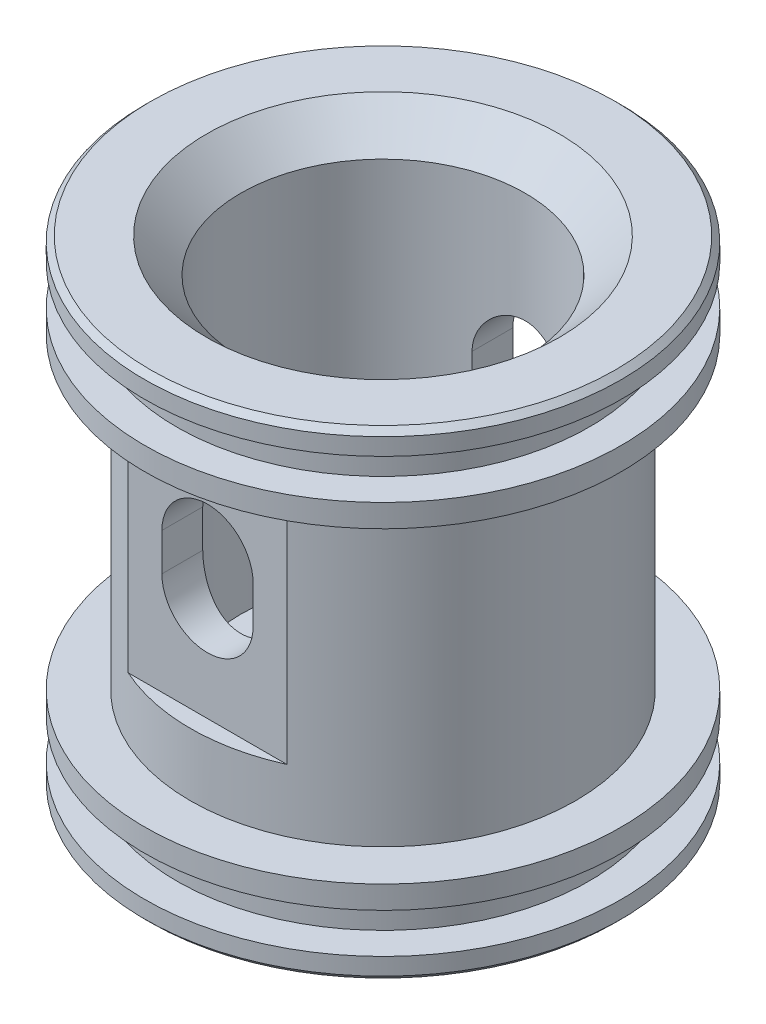
ISO-10303-21;
HEADER;
FILE_DESCRIPTION(('STEP AP214'),'2;1');
FILE_NAME('part.step','',(''),(''),'','','');
FILE_SCHEMA(('AUTOMOTIVE_DESIGN { 1 0 10303 214 1 1 1 1 }'));
ENDSEC;
DATA;
#1=APPLICATION_CONTEXT('core data for automotive mechanical design processes');
#2=APPLICATION_PROTOCOL_DEFINITION('international standard','automotive_design',2000,#1);
#3=PRODUCT_CONTEXT('',#1,'mechanical');
#4=PRODUCT('Part','Part','',(#3));
#5=PRODUCT_RELATED_PRODUCT_CATEGORY('part','',(#4));
#6=PRODUCT_DEFINITION_FORMATION('','',#4);
#7=PRODUCT_DEFINITION_CONTEXT('part definition',#1,'design');
#8=PRODUCT_DEFINITION('design','',#6,#7);
#9=PRODUCT_DEFINITION_SHAPE('','',#8);
#10=(LENGTH_UNIT() NAMED_UNIT(*) SI_UNIT(.MILLI.,.METRE.));
#11=(NAMED_UNIT(*) PLANE_ANGLE_UNIT() SI_UNIT($,.RADIAN.));
#12=(NAMED_UNIT(*) SI_UNIT($,.STERADIAN.) SOLID_ANGLE_UNIT());
#13=UNCERTAINTY_MEASURE_WITH_UNIT(LENGTH_MEASURE(1.E-05),#10,'distance_accuracy_value','');
#14=(GEOMETRIC_REPRESENTATION_CONTEXT(3) GLOBAL_UNCERTAINTY_ASSIGNED_CONTEXT((#13)) GLOBAL_UNIT_ASSIGNED_CONTEXT((#10,
#11,#12)) REPRESENTATION_CONTEXT('',''));
#15=CARTESIAN_POINT('',(0.,0.,0.));
#16=DIRECTION('',(0.,0.,1.));
#17=DIRECTION('',(1.,0.,0.));
#18=AXIS2_PLACEMENT_3D('',#15,#16,#17);
#19=CARTESIAN_POINT('',(0.,-7.,0.));
#20=DIRECTION('',(0.,1.,0.));
#21=DIRECTION('',(-1.,0.,0.));
#22=AXIS2_PLACEMENT_3D('',#19,#20,#21);
#23=PLANE('',#22);
#24=CARTESIAN_POINT('',(0.,-7.,0.));
#25=DIRECTION('',(0.,-1.,0.));
#26=DIRECTION('',(1.,0.,0.));
#27=AXIS2_PLACEMENT_3D('',#24,#25,#26);
#28=CIRCLE('',#27,4.);
#29=CARTESIAN_POINT('',(4.,-7.,0.));
#30=VERTEX_POINT('',#29);
#31=EDGE_CURVE('E226',#30,#30,#28,.T.);
#32=ORIENTED_EDGE('',*,*,#31,.F.);
#33=EDGE_LOOP('',(#32));
#34=FACE_BOUND('',#33,.T.);
#35=CARTESIAN_POINT('',(0.,-7.,0.));
#36=DIRECTION('',(0.,1.,0.));
#37=DIRECTION('',(-1.,0.,0.));
#38=AXIS2_PLACEMENT_3D('',#35,#36,#37);
#39=CIRCLE('',#38,20.4);
#40=CARTESIAN_POINT('',(-20.4,-7.,0.));
#41=VERTEX_POINT('',#40);
#42=EDGE_CURVE('E279',#41,#41,#39,.F.);
#43=ORIENTED_EDGE('',*,*,#42,.T.);
#44=EDGE_LOOP('',(#43));
#45=FACE_BOUND('',#44,.T.);
#46=ADVANCED_FACE('F34',(#34,#45),#23,.F.);
#47=CARTESIAN_POINT('',(0.,0.,0.));
#48=DIRECTION('',(0.,1.,0.));
#49=DIRECTION('',(-1.,0.,0.));
#50=AXIS2_PLACEMENT_3D('',#47,#48,#49);
#51=CYLINDRICAL_SURFACE('',#50,20.9);
#52=CARTESIAN_POINT('',(0.,-6.50000000000001,0.));
#53=DIRECTION('',(0.,1.,0.));
#54=DIRECTION('',(-1.,0.,0.));
#55=AXIS2_PLACEMENT_3D('',#52,#53,#54);
#56=CIRCLE('',#55,20.9);
#57=CARTESIAN_POINT('',(-20.9,-6.50000000000001,0.));
#58=VERTEX_POINT('',#57);
#59=EDGE_CURVE('E276',#58,#58,#56,.T.);
#60=ORIENTED_EDGE('',*,*,#59,.T.);
#61=EDGE_LOOP('',(#60));
#62=FACE_BOUND('',#61,.T.);
#63=CARTESIAN_POINT('',(0.,-5.,0.));
#64=DIRECTION('',(0.,1.,0.));
#65=DIRECTION('',(-1.,0.,0.));
#66=AXIS2_PLACEMENT_3D('',#63,#64,#65);
#67=CIRCLE('',#66,20.9);
#68=CARTESIAN_POINT('',(-20.9,-5.,0.));
#69=VERTEX_POINT('',#68);
#70=EDGE_CURVE('E267',#69,#69,#67,.T.);
#71=ORIENTED_EDGE('',*,*,#70,.F.);
#72=EDGE_LOOP('',(#71));
#73=FACE_BOUND('',#72,.T.);
#74=ADVANCED_FACE('F340',(#62,#73),#51,.T.);
#75=CARTESIAN_POINT('',(18.1,-5.,0.));
#76=DIRECTION('',(0.,-1.,0.));
#77=DIRECTION('',(1.,0.,0.));
#78=AXIS2_PLACEMENT_3D('',#75,#76,#77);
#79=PLANE('',#78);
#80=CARTESIAN_POINT('',(0.,-5.,0.));
#81=DIRECTION('',(0.,1.,0.));
#82=DIRECTION('',(-1.,0.,0.));
#83=AXIS2_PLACEMENT_3D('',#80,#81,#82);
#84=CIRCLE('',#83,18.1);
#85=CARTESIAN_POINT('',(-18.1,-5.,0.));
#86=VERTEX_POINT('',#85);
#87=EDGE_CURVE('E264',#86,#86,#84,.T.);
#88=ORIENTED_EDGE('',*,*,#87,.F.);
#89=EDGE_LOOP('',(#88));
#90=FACE_BOUND('',#89,.T.);
#91=ORIENTED_EDGE('',*,*,#70,.T.);
#92=EDGE_LOOP('',(#91));
#93=FACE_BOUND('',#92,.T.);
#94=ADVANCED_FACE('F346',(#90,#93),#79,.F.);
#95=CARTESIAN_POINT('',(0.,0.,0.));
#96=DIRECTION('',(0.,1.,0.));
#97=DIRECTION('',(-1.,0.,0.));
#98=AXIS2_PLACEMENT_3D('',#95,#96,#97);
#99=CYLINDRICAL_SURFACE('',#98,18.1);
#100=CARTESIAN_POINT('',(0.,-1.5,0.));
#101=DIRECTION('',(0.,1.,0.));
#102=DIRECTION('',(-1.,0.,0.));
#103=AXIS2_PLACEMENT_3D('',#100,#101,#102);
#104=CIRCLE('',#103,18.1);
#105=CARTESIAN_POINT('',(-18.1,-1.5,0.));
#106=VERTEX_POINT('',#105);
#107=EDGE_CURVE('E261',#106,#106,#104,.T.);
#108=ORIENTED_EDGE('',*,*,#107,.F.);
#109=EDGE_LOOP('',(#108));
#110=FACE_BOUND('',#109,.T.);
#111=ORIENTED_EDGE('',*,*,#87,.T.);
#112=EDGE_LOOP('',(#111));
#113=FACE_BOUND('',#112,.T.);
#114=ADVANCED_FACE('F372',(#110,#113),#99,.T.);
#115=CARTESIAN_POINT('',(18.1,-1.49999999999999,0.));
#116=DIRECTION('',(0.,1.,0.));
#117=DIRECTION('',(-1.,0.,0.));
#118=AXIS2_PLACEMENT_3D('',#115,#116,#117);
#119=PLANE('',#118);
#120=CARTESIAN_POINT('',(0.,-1.5,0.));
#121=DIRECTION('',(0.,1.,0.));
#122=DIRECTION('',(-1.,0.,0.));
#123=AXIS2_PLACEMENT_3D('',#120,#121,#122);
#124=CIRCLE('',#123,20.9);
#125=CARTESIAN_POINT('',(-20.9,-1.5,0.));
#126=VERTEX_POINT('',#125);
#127=EDGE_CURVE('E258',#126,#126,#124,.T.);
#128=ORIENTED_EDGE('',*,*,#127,.F.);
#129=EDGE_LOOP('',(#128));
#130=FACE_BOUND('',#129,.T.);
#131=ORIENTED_EDGE('',*,*,#107,.T.);
#132=EDGE_LOOP('',(#131));
#133=FACE_BOUND('',#132,.T.);
#134=ADVANCED_FACE('F377',(#130,#133),#119,.F.);
#135=CARTESIAN_POINT('',(0.,0.,0.));
#136=DIRECTION('',(0.,1.,0.));
#137=DIRECTION('',(-1.,0.,0.));
#138=AXIS2_PLACEMENT_3D('',#135,#136,#137);
#139=CYLINDRICAL_SURFACE('',#138,20.9);
#140=CARTESIAN_POINT('',(0.,0.500000000000004,0.));
#141=DIRECTION('',(0.,1.,0.));
#142=DIRECTION('',(-1.,0.,0.));
#143=AXIS2_PLACEMENT_3D('',#140,#141,#142);
#144=CIRCLE('',#143,20.9);
#145=CARTESIAN_POINT('',(-20.9,0.500000000000001,0.));
#146=VERTEX_POINT('',#145);
#147=EDGE_CURVE('E255',#146,#146,#144,.T.);
#148=ORIENTED_EDGE('',*,*,#147,.F.);
#149=EDGE_LOOP('',(#148));
#150=FACE_BOUND('',#149,.T.);
#151=ORIENTED_EDGE('',*,*,#127,.T.);
#152=EDGE_LOOP('',(#151));
#153=FACE_BOUND('',#152,.T.);
#154=ADVANCED_FACE('F384',(#150,#153),#139,.T.);
#155=CARTESIAN_POINT('',(16.9,0.500000000000006,0.));
#156=DIRECTION('',(0.,-1.,0.));
#157=DIRECTION('',(1.,0.,0.));
#158=AXIS2_PLACEMENT_3D('',#155,#156,#157);
#159=PLANE('',#158);
#160=CARTESIAN_POINT('',(0.,0.500000000000004,0.));
#161=DIRECTION('',(0.,1.,0.));
#162=DIRECTION('',(-1.,0.,0.));
#163=AXIS2_PLACEMENT_3D('',#160,#161,#162);
#164=CIRCLE('',#163,16.9);
#165=CARTESIAN_POINT('',(-16.9,0.500000000000002,0.));
#166=VERTEX_POINT('',#165);
#167=EDGE_CURVE('E252',#166,#166,#164,.T.);
#168=ORIENTED_EDGE('',*,*,#167,.F.);
#169=EDGE_LOOP('',(#168));
#170=FACE_BOUND('',#169,.T.);
#171=ORIENTED_EDGE('',*,*,#147,.T.);
#172=EDGE_LOOP('',(#171));
#173=FACE_BOUND('',#172,.T.);
#174=ADVANCED_FACE('F388',(#170,#173),#159,.F.);
#175=CARTESIAN_POINT('',(0.,0.,0.));
#176=DIRECTION('',(0.,1.,0.));
#177=DIRECTION('',(-1.,0.,0.));
#178=AXIS2_PLACEMENT_3D('',#175,#176,#177);
#179=CYLINDRICAL_SURFACE('',#178,16.9);
#180=CARTESIAN_POINT('',(0.,5.99999999999999,0.));
#181=DIRECTION('',(0.,-1.,0.));
#182=DIRECTION('',(0.,0.,-1.));
#183=AXIS2_PLACEMENT_3D('',#180,#181,#182);
#184=CIRCLE('',#183,16.9);
#185=CARTESIAN_POINT('',(-6.96060342211793,5.99999999999999,-15.4));
#186=VERTEX_POINT('',#185);
#187=CARTESIAN_POINT('',(6.96060342211793,5.99999999999999,-15.4));
#188=VERTEX_POINT('',#187);
#189=EDGE_CURVE('E293',#186,#188,#184,.T.);
#190=ORIENTED_EDGE('',*,*,#189,.T.);
#191=DIRECTION('',(0.,1.,0.));
#192=VECTOR('',#191,1.);
#193=CARTESIAN_POINT('',(6.96060342211793,0.,-15.4));
#194=LINE('',#193,#192);
#195=CARTESIAN_POINT('',(6.96060342211794,27.5,-15.4));
#196=VERTEX_POINT('',#195);
#197=EDGE_CURVE('E223',#188,#196,#194,.T.);
#198=ORIENTED_EDGE('',*,*,#197,.T.);
#199=CARTESIAN_POINT('',(0.,27.5,0.));
#200=DIRECTION('',(0.,1.,0.));
#201=DIRECTION('',(-1.,0.,0.));
#202=AXIS2_PLACEMENT_3D('',#199,#200,#201);
#203=CIRCLE('',#202,16.9);
#204=CARTESIAN_POINT('',(6.96060342211794,27.5,15.4));
#205=VERTEX_POINT('',#204);
#206=EDGE_CURVE('E251',#205,#196,#203,.T.);
#207=ORIENTED_EDGE('',*,*,#206,.F.);
#208=DIRECTION('',(0.,1.,0.));
#209=VECTOR('',#208,1.);
#210=CARTESIAN_POINT('',(6.96060342211795,0.,15.4));
#211=LINE('',#210,#209);
#212=CARTESIAN_POINT('',(6.96060342211795,5.99999999999999,15.4));
#213=VERTEX_POINT('',#212);
#214=EDGE_CURVE('E206',#205,#213,#211,.F.);
#215=ORIENTED_EDGE('',*,*,#214,.T.);
#216=CARTESIAN_POINT('',(0.,5.99999999999999,0.));
#217=DIRECTION('',(0.,-1.,0.));
#218=DIRECTION('',(0.,0.,-1.));
#219=AXIS2_PLACEMENT_3D('',#216,#217,#218);
#220=CIRCLE('',#219,16.9);
#221=CARTESIAN_POINT('',(-6.96060342211795,5.99999999999999,15.4));
#222=VERTEX_POINT('',#221);
#223=EDGE_CURVE('E288',#213,#222,#220,.T.);
#224=ORIENTED_EDGE('',*,*,#223,.T.);
#225=DIRECTION('',(0.,1.,0.));
#226=VECTOR('',#225,1.);
#227=CARTESIAN_POINT('',(-6.96060342211795,0.,15.4));
#228=LINE('',#227,#226);
#229=CARTESIAN_POINT('',(-6.96060342211795,27.5,15.4));
#230=VERTEX_POINT('',#229);
#231=EDGE_CURVE('E217',#222,#230,#228,.T.);
#232=ORIENTED_EDGE('',*,*,#231,.T.);
#233=CARTESIAN_POINT('',(-6.96060342211795,27.5,-15.4));
#234=VERTEX_POINT('',#233);
#235=EDGE_CURVE('E248',#234,#230,#203,.T.);
#236=ORIENTED_EDGE('',*,*,#235,.F.);
#237=DIRECTION('',(0.,1.,0.));
#238=VECTOR('',#237,1.);
#239=CARTESIAN_POINT('',(-6.96060342211793,0.,-15.4));
#240=LINE('',#239,#238);
#241=EDGE_CURVE('E220',#234,#186,#240,.F.);
#242=ORIENTED_EDGE('',*,*,#241,.T.);
#243=EDGE_LOOP('',(#190,#198,#207,#215,#224,#232,#236,#242));
#244=FACE_BOUND('',#243,.T.);
#245=ORIENTED_EDGE('',*,*,#167,.T.);
#246=EDGE_LOOP('',(#245));
#247=FACE_BOUND('',#246,.T.);
#248=ADVANCED_FACE('F392',(#244,#247),#179,.T.);
#249=CARTESIAN_POINT('',(16.9,27.5,0.));
#250=DIRECTION('',(0.,1.,0.));
#251=DIRECTION('',(-1.,0.,0.));
#252=AXIS2_PLACEMENT_3D('',#249,#250,#251);
#253=PLANE('',#252);
#254=DIRECTION('',(1.,0.,0.));
#255=VECTOR('',#254,1.);
#256=CARTESIAN_POINT('',(-20.9,27.5,15.4));
#257=LINE('',#256,#255);
#258=EDGE_CURVE('E210',#230,#205,#257,.T.);
#259=ORIENTED_EDGE('',*,*,#258,.T.);
#260=ORIENTED_EDGE('',*,*,#206,.T.);
#261=DIRECTION('',(1.,0.,0.));
#262=VECTOR('',#261,1.);
#263=CARTESIAN_POINT('',(-20.9,27.5,-15.4));
#264=LINE('',#263,#262);
#265=EDGE_CURVE('E204',#234,#196,#264,.T.);
#266=ORIENTED_EDGE('',*,*,#265,.F.);
#267=ORIENTED_EDGE('',*,*,#235,.T.);
#268=EDGE_LOOP('',(#259,#260,#266,#267));
#269=FACE_BOUND('',#268,.T.);
#270=CARTESIAN_POINT('',(0.,27.5,0.));
#271=DIRECTION('',(0.,1.,0.));
#272=DIRECTION('',(-1.,0.,0.));
#273=AXIS2_PLACEMENT_3D('',#270,#271,#272);
#274=CIRCLE('',#273,20.9);
#275=CARTESIAN_POINT('',(-20.9,27.5,0.));
#276=VERTEX_POINT('',#275);
#277=EDGE_CURVE('E245',#276,#276,#274,.T.);
#278=ORIENTED_EDGE('',*,*,#277,.F.);
#279=EDGE_LOOP('',(#278));
#280=FACE_BOUND('',#279,.T.);
#281=ADVANCED_FACE('F396',(#269,#280),#253,.F.);
#282=CARTESIAN_POINT('',(0.,0.,0.));
#283=DIRECTION('',(0.,1.,0.));
#284=DIRECTION('',(-1.,0.,0.));
#285=AXIS2_PLACEMENT_3D('',#282,#283,#284);
#286=CYLINDRICAL_SURFACE('',#285,20.9);
#287=CARTESIAN_POINT('',(0.,29.5,0.));
#288=DIRECTION('',(0.,1.,0.));
#289=DIRECTION('',(-1.,0.,0.));
#290=AXIS2_PLACEMENT_3D('',#287,#288,#289);
#291=CIRCLE('',#290,20.9);
#292=CARTESIAN_POINT('',(-20.9,29.5,0.));
#293=VERTEX_POINT('',#292);
#294=EDGE_CURVE('E242',#293,#293,#291,.T.);
#295=ORIENTED_EDGE('',*,*,#294,.F.);
#296=EDGE_LOOP('',(#295));
#297=FACE_BOUND('',#296,.T.);
#298=ORIENTED_EDGE('',*,*,#277,.T.);
#299=EDGE_LOOP('',(#298));
#300=FACE_BOUND('',#299,.T.);
#301=ADVANCED_FACE('F400',(#297,#300),#286,.T.);
#302=CARTESIAN_POINT('',(18.1,29.5,0.));
#303=DIRECTION('',(0.,-1.,0.));
#304=DIRECTION('',(1.,0.,0.));
#305=AXIS2_PLACEMENT_3D('',#302,#303,#304);
#306=PLANE('',#305);
#307=CARTESIAN_POINT('',(0.,29.5,0.));
#308=DIRECTION('',(0.,1.,0.));
#309=DIRECTION('',(-1.,0.,0.));
#310=AXIS2_PLACEMENT_3D('',#307,#308,#309);
#311=CIRCLE('',#310,18.1);
#312=CARTESIAN_POINT('',(-18.1,29.5,0.));
#313=VERTEX_POINT('',#312);
#314=EDGE_CURVE('E239',#313,#313,#311,.T.);
#315=ORIENTED_EDGE('',*,*,#314,.F.);
#316=EDGE_LOOP('',(#315));
#317=FACE_BOUND('',#316,.T.);
#318=ORIENTED_EDGE('',*,*,#294,.T.);
#319=EDGE_LOOP('',(#318));
#320=FACE_BOUND('',#319,.T.);
#321=ADVANCED_FACE('F404',(#317,#320),#306,.F.);
#322=CARTESIAN_POINT('',(0.,0.,0.));
#323=DIRECTION('',(0.,1.,0.));
#324=DIRECTION('',(-1.,0.,0.));
#325=AXIS2_PLACEMENT_3D('',#322,#323,#324);
#326=CYLINDRICAL_SURFACE('',#325,18.1);
#327=CARTESIAN_POINT('',(0.,33.,0.));
#328=DIRECTION('',(0.,1.,0.));
#329=DIRECTION('',(-1.,0.,0.));
#330=AXIS2_PLACEMENT_3D('',#327,#328,#329);
#331=CIRCLE('',#330,18.1);
#332=CARTESIAN_POINT('',(-18.1,33.,0.));
#333=VERTEX_POINT('',#332);
#334=EDGE_CURVE('E236',#333,#333,#331,.T.);
#335=ORIENTED_EDGE('',*,*,#334,.F.);
#336=EDGE_LOOP('',(#335));
#337=FACE_BOUND('',#336,.T.);
#338=ORIENTED_EDGE('',*,*,#314,.T.);
#339=EDGE_LOOP('',(#338));
#340=FACE_BOUND('',#339,.T.);
#341=ADVANCED_FACE('F408',(#337,#340),#326,.T.);
#342=CARTESIAN_POINT('',(18.1,33.,0.));
#343=DIRECTION('',(0.,1.,0.));
#344=DIRECTION('',(-1.,0.,0.));
#345=AXIS2_PLACEMENT_3D('',#342,#343,#344);
#346=PLANE('',#345);
#347=CARTESIAN_POINT('',(0.,33.,0.));
#348=DIRECTION('',(0.,1.,0.));
#349=DIRECTION('',(-1.,0.,0.));
#350=AXIS2_PLACEMENT_3D('',#347,#348,#349);
#351=CIRCLE('',#350,20.9);
#352=CARTESIAN_POINT('',(-20.9,33.,0.));
#353=VERTEX_POINT('',#352);
#354=EDGE_CURVE('E233',#353,#353,#351,.T.);
#355=ORIENTED_EDGE('',*,*,#354,.F.);
#356=EDGE_LOOP('',(#355));
#357=FACE_BOUND('',#356,.T.);
#358=ORIENTED_EDGE('',*,*,#334,.T.);
#359=EDGE_LOOP('',(#358));
#360=FACE_BOUND('',#359,.T.);
#361=ADVANCED_FACE('F412',(#357,#360),#346,.F.);
#362=CARTESIAN_POINT('',(0.,0.,0.));
#363=DIRECTION('',(0.,1.,0.));
#364=DIRECTION('',(-1.,0.,0.));
#365=AXIS2_PLACEMENT_3D('',#362,#363,#364);
#366=CYLINDRICAL_SURFACE('',#365,20.9);
#367=CARTESIAN_POINT('',(0.,34.5,0.));
#368=DIRECTION('',(0.,-1.,0.));
#369=DIRECTION('',(1.,0.,0.));
#370=AXIS2_PLACEMENT_3D('',#367,#368,#369);
#371=CIRCLE('',#370,20.9);
#372=CARTESIAN_POINT('',(20.9,34.5,0.));
#373=VERTEX_POINT('',#372);
#374=EDGE_CURVE('E285',#373,#373,#371,.T.);
#375=ORIENTED_EDGE('',*,*,#374,.T.);
#376=EDGE_LOOP('',(#375));
#377=FACE_BOUND('',#376,.T.);
#378=ORIENTED_EDGE('',*,*,#354,.T.);
#379=EDGE_LOOP('',(#378));
#380=FACE_BOUND('',#379,.T.);
#381=ADVANCED_FACE('F416',(#377,#380),#366,.T.);
#382=CARTESIAN_POINT('',(12.475,35.,0.));
#383=DIRECTION('',(0.,-1.,0.));
#384=DIRECTION('',(1.,0.,0.));
#385=AXIS2_PLACEMENT_3D('',#382,#383,#384);
#386=PLANE('',#385);
#387=CARTESIAN_POINT('',(0.,35.,0.));
#388=DIRECTION('',(0.,-1.,0.));
#389=DIRECTION('',(1.,0.,0.));
#390=AXIS2_PLACEMENT_3D('',#387,#388,#389);
#391=CIRCLE('',#390,20.4);
#392=CARTESIAN_POINT('',(20.4,35.,0.));
#393=VERTEX_POINT('',#392);
#394=EDGE_CURVE('E282',#393,#393,#391,.F.);
#395=ORIENTED_EDGE('',*,*,#394,.T.);
#396=EDGE_LOOP('',(#395));
#397=FACE_BOUND('',#396,.T.);
#398=CARTESIAN_POINT('',(0.,35.,0.));
#399=DIRECTION('',(0.,-1.,0.));
#400=DIRECTION('',(1.,0.,0.));
#401=AXIS2_PLACEMENT_3D('',#398,#399,#400);
#402=CIRCLE('',#401,15.475);
#403=CARTESIAN_POINT('',(15.475,35.,0.));
#404=VERTEX_POINT('',#403);
#405=EDGE_CURVE('E273',#404,#404,#402,.T.);
#406=ORIENTED_EDGE('',*,*,#405,.T.);
#407=EDGE_LOOP('',(#406));
#408=FACE_BOUND('',#407,.T.);
#409=ADVANCED_FACE('F419',(#397,#408),#386,.F.);
#410=CARTESIAN_POINT('',(0.,0.,0.));
#411=DIRECTION('',(0.,1.,0.));
#412=DIRECTION('',(-1.,0.,0.));
#413=AXIS2_PLACEMENT_3D('',#410,#411,#412);
#414=CYLINDRICAL_SURFACE('',#413,12.475);
#415=DIRECTION('',(0.,1.,0.));
#416=VECTOR('',#415,1.);
#417=CARTESIAN_POINT('',(4.,0.,11.8163287445805));
#418=LINE('',#417,#416);
#419=CARTESIAN_POINT('',(4.,15.,11.8163287445805));
#420=VERTEX_POINT('',#419);
#421=CARTESIAN_POINT('',(4.,18.3,11.8163287445805));
#422=VERTEX_POINT('',#421);
#423=EDGE_CURVE('E150',#420,#422,#418,.T.);
#424=ORIENTED_EDGE('',*,*,#423,.T.);
#425=CARTESIAN_POINT('',(4.,18.3,11.8163287445805));
#426=CARTESIAN_POINT('',(4.00001411809902,18.4093871271885,11.8163121579737));
#427=CARTESIAN_POINT('',(3.99551321364773,18.518764901796,11.817847300837));
#428=CARTESIAN_POINT('',(3.9775912855489,18.7366774376749,11.8238976573683));
#429=CARTESIAN_POINT('',(3.96417250993629,18.8452124044291,11.8284121200015));
#430=CARTESIAN_POINT('',(3.92857432770602,19.0603707727574,11.8402812842675));
#431=CARTESIAN_POINT('',(3.9064194357263,19.1669986580237,11.8476280368625));
#432=CARTESIAN_POINT('',(3.85357218265485,19.3778741099753,11.8649220177327));
#433=CARTESIAN_POINT('',(3.82287954697863,19.4821215999874,11.8748693296446));
#434=CARTESIAN_POINT('',(3.71839062333322,19.7901181819552,11.9081738697607));
#435=CARTESIAN_POINT('',(3.63213295424016,19.9894222577234,11.9350115744333));
#436=CARTESIAN_POINT('',(3.42910750798947,20.3707483838284,11.9949149415357));
#437=CARTESIAN_POINT('',(3.31232277183714,20.5527607510626,12.027984062905));
#438=CARTESIAN_POINT('',(3.04704083992631,20.9009534461415,12.0979565670378));
#439=CARTESIAN_POINT('',(2.8976334657215,21.0664236778121,12.1349498346541));
#440=CARTESIAN_POINT('',(2.57329383345587,21.3704380214078,12.2078407715799));
#441=CARTESIAN_POINT('',(2.39835713631806,21.5089774407731,12.2437382490365));
#442=CARTESIAN_POINT('',(2.02274889484768,21.7583945055455,12.3114310444295));
#443=CARTESIAN_POINT('',(1.82156145778234,21.8685304076678,12.3431075625728));
#444=CARTESIAN_POINT('',(1.40233668510284,22.0531142698425,12.3977287375453));
#445=CARTESIAN_POINT('',(1.18430420101149,22.1275724612264,12.4206758973115));
#446=CARTESIAN_POINT('',(0.745062807786656,22.2362924544287,12.4546149782665));
#447=CARTESIAN_POINT('',(0.524185252474832,22.2717775478875,12.4659698914053));
#448=CARTESIAN_POINT('',(0.0793344154626429,22.3054252213604,12.4767297225219));
#449=CARTESIAN_POINT('',(-0.144638177576508,22.3035959745141,12.4761372573919));
#450=CARTESIAN_POINT('',(-0.580684670446355,22.2634593473421,12.4633187881711));
#451=CARTESIAN_POINT('',(-0.792895235698902,22.2264796289794,12.4515162115729));
#452=CARTESIAN_POINT('',(-1.20791941657586,22.1192766755092,12.4181287544171));
#453=CARTESIAN_POINT('',(-1.41073251931046,22.0490516282962,12.3965433406285));
#454=CARTESIAN_POINT('',(-1.80420941235633,21.876530671288,12.3454585091369));
#455=CARTESIAN_POINT('',(-1.99468763894148,21.7738413194747,12.3158626807403));
#456=CARTESIAN_POINT('',(-2.35611529116862,21.5396163493356,12.2518603293324));
#457=CARTESIAN_POINT('',(-2.5270597375696,21.4080734009462,12.2174525846924));
#458=CARTESIAN_POINT('',(-2.85244792296549,21.1131585176819,12.1457050631507));
#459=CARTESIAN_POINT('',(-3.00584502770404,20.948647442972,12.1083028624458));
#460=CARTESIAN_POINT('',(-3.28327099090088,20.5957453066817,12.0360447118581));
#461=CARTESIAN_POINT('',(-3.40729077721194,20.4073468958451,12.0011895508304));
#462=CARTESIAN_POINT('',(-3.56918391654148,20.1094148291194,11.9536506214211));
#463=CARTESIAN_POINT('',(-3.61938453221583,20.0067910242979,11.938507883318));
#464=CARTESIAN_POINT('',(-3.71091047639193,19.7973898544998,11.9103762643054));
#465=CARTESIAN_POINT('',(-3.7522394745617,19.6906142285594,11.8973864933482));
#466=CARTESIAN_POINT('',(-3.82561550871638,19.4737792388747,11.8739957518597));
#467=CARTESIAN_POINT('',(-3.85767249582395,19.3637235364811,11.8635920075924));
#468=CARTESIAN_POINT('',(-3.91225062446589,19.1410847765805,11.8457056351225));
#469=CARTESIAN_POINT('',(-3.93477613679842,19.0285029024819,11.8382216681361));
#470=CARTESIAN_POINT('',(-3.96824944354349,18.8134023587593,11.8270416332406));
#471=CARTESIAN_POINT('',(-3.98015399675296,18.7110477007547,11.8230337643364));
#472=CARTESIAN_POINT('',(-3.99602938404384,18.5057980107363,11.8176726302481));
#473=CARTESIAN_POINT('',(-4.00001107546178,18.4029039122337,11.816315732271));
#474=CARTESIAN_POINT('',(-4.,18.3,11.8163287445805));
#475=B_SPLINE_CURVE_WITH_KNOTS('',3,(#425,#426,#427,#428,#429,#430,#431,#432,#433,#434,#435,
#436,#437,#438,#439,#440,#441,#442,#443,#444,#445,#446,#447,#448,#449,#450,#451,#452,#453,#454,
#455,#456,#457,#458,#459,#460,#461,#462,#463,#464,#465,#466,#467,#468,#469,#470,#471,#472,#473,
#474),.UNSPECIFIED.,.F.,.F.,(4,2,2,2,2,2,2,2,2,2,2,2,2,2,2,2,2,2,2,2,2,2,2,2,4),(0.,
0.328042200812202,0.656001739436668,0.983047457839286,1.3101036956569,1.96331094920039,
2.61688185933126,3.29177183193262,3.96677929554941,4.65794880373992,5.34891998578659,
6.01752144101551,6.68597645082296,7.33014654475873,7.97435175456344,8.62668453958354,
9.27918323772662,9.96017749912916,10.6413817881856,10.9867515349323,11.3319781459959,
11.6768328583185,12.0215292606045,12.3305613524961,12.6391696603262),.UNSPECIFIED.);
#476=CARTESIAN_POINT('',(-4.,18.3,11.8163287445805));
#477=VERTEX_POINT('',#476);
#478=EDGE_CURVE('E190',#422,#477,#475,.T.);
#479=ORIENTED_EDGE('',*,*,#478,.T.);
#480=DIRECTION('',(0.,1.,0.));
#481=VECTOR('',#480,1.);
#482=CARTESIAN_POINT('',(-4.,0.,11.8163287445805));
#483=LINE('',#482,#481);
#484=CARTESIAN_POINT('',(-4.,15.,11.8163287445805));
#485=VERTEX_POINT('',#484);
#486=EDGE_CURVE('E129',#477,#485,#483,.F.);
#487=ORIENTED_EDGE('',*,*,#486,.T.);
#488=CARTESIAN_POINT('',(-4.,15.,11.8163287445805));
#489=CARTESIAN_POINT('',(-4.00001411809902,14.8906128728115,11.8163121579737));
#490=CARTESIAN_POINT('',(-3.99551321364772,14.781235098204,11.817847300837));
#491=CARTESIAN_POINT('',(-3.9775912855489,14.5633225623251,11.8238976573683));
#492=CARTESIAN_POINT('',(-3.96417250993629,14.4547875955709,11.8284121200015));
#493=CARTESIAN_POINT('',(-3.92857432770603,14.2396292272426,11.8402812842675));
#494=CARTESIAN_POINT('',(-3.9064194357263,14.1330013419763,11.8476280368625));
#495=CARTESIAN_POINT('',(-3.85357218265485,13.9221258900247,11.8649220177327));
#496=CARTESIAN_POINT('',(-3.82287954697863,13.8178784000126,11.8748693296446));
#497=CARTESIAN_POINT('',(-3.71839062333321,13.5098818180448,11.9081738697607));
#498=CARTESIAN_POINT('',(-3.63213295424016,13.3105777422766,11.9350115744333));
#499=CARTESIAN_POINT('',(-3.42910750798947,12.9292516161716,11.9949149415357));
#500=CARTESIAN_POINT('',(-3.31232277183714,12.7472392489374,12.027984062905));
#501=CARTESIAN_POINT('',(-3.04704083992632,12.3990465538585,12.0979565670378));
#502=CARTESIAN_POINT('',(-2.8976334657215,12.2335763221879,12.1349498346541));
#503=CARTESIAN_POINT('',(-2.57329383345587,11.9295619785922,12.2078407715799));
#504=CARTESIAN_POINT('',(-2.39835713631806,11.7910225592269,12.2437382490365));
#505=CARTESIAN_POINT('',(-2.02274889484768,11.5416054944545,12.3114310444295));
#506=CARTESIAN_POINT('',(-1.82156145778234,11.4314695923322,12.3431075625728));
#507=CARTESIAN_POINT('',(-1.40233668510284,11.2468857301575,12.3977287375453));
#508=CARTESIAN_POINT('',(-1.18430420101149,11.1724275387736,12.4206758973115));
#509=CARTESIAN_POINT('',(-0.745062807786656,11.0637075455713,12.4546149782665));
#510=CARTESIAN_POINT('',(-0.524185252474832,11.0282224521125,12.4659698914053));
#511=CARTESIAN_POINT('',(-0.0793344154626426,10.9945747786396,12.4767297225219));
#512=CARTESIAN_POINT('',(0.144638177576508,10.9964040254859,12.4761372573919));
#513=CARTESIAN_POINT('',(0.580684670446356,11.0365406526579,12.4633187881711));
#514=CARTESIAN_POINT('',(0.792895235698904,11.0735203710206,12.4515162115729));
#515=CARTESIAN_POINT('',(1.20791941657587,11.1807233244908,12.4181287544171));
#516=CARTESIAN_POINT('',(1.41073251931046,11.2509483717038,12.3965433406285));
#517=CARTESIAN_POINT('',(1.80420941235633,11.423469328712,12.3454585091369));
#518=CARTESIAN_POINT('',(1.99468763894148,11.5261586805253,12.3158626807403));
#519=CARTESIAN_POINT('',(2.35611529116862,11.7603836506644,12.2518603293324));
#520=CARTESIAN_POINT('',(2.5270597375696,11.8919265990538,12.2174525846924));
#521=CARTESIAN_POINT('',(2.85244792296549,12.1868414823181,12.1457050631507));
#522=CARTESIAN_POINT('',(3.00584502770404,12.351352557028,12.1083028624458));
#523=CARTESIAN_POINT('',(3.28327099090089,12.7042546933183,12.0360447118581));
#524=CARTESIAN_POINT('',(3.40729077721194,12.8926531041549,12.0011895508304));
#525=CARTESIAN_POINT('',(3.56918391654148,13.1905851708806,11.9536506214211));
#526=CARTESIAN_POINT('',(3.61938453221584,13.2932089757021,11.938507883318));
#527=CARTESIAN_POINT('',(3.71091047639193,13.5026101455002,11.9103762643054));
#528=CARTESIAN_POINT('',(3.7522394745617,13.6093857714406,11.8973864933482));
#529=CARTESIAN_POINT('',(3.82561550871639,13.8262207611253,11.8739957518597));
#530=CARTESIAN_POINT('',(3.85767249582395,13.9362764635189,11.8635920075924));
#531=CARTESIAN_POINT('',(3.91225062446589,14.1589152234195,11.8457056351225));
#532=CARTESIAN_POINT('',(3.93477613679842,14.2714970975181,11.8382216681361));
#533=CARTESIAN_POINT('',(3.96824944354349,14.4865976412408,11.8270416332406));
#534=CARTESIAN_POINT('',(3.98015399675296,14.5889522992453,11.8230337643364));
#535=CARTESIAN_POINT('',(3.99602938404384,14.7942019892637,11.8176726302481));
#536=CARTESIAN_POINT('',(4.00001107546178,14.8970960877663,11.816315732271));
#537=CARTESIAN_POINT('',(4.,15.,11.8163287445805));
#538=B_SPLINE_CURVE_WITH_KNOTS('',3,(#488,#489,#490,#491,#492,#493,#494,#495,#496,#497,#498,
#499,#500,#501,#502,#503,#504,#505,#506,#507,#508,#509,#510,#511,#512,#513,#514,#515,#516,#517,
#518,#519,#520,#521,#522,#523,#524,#525,#526,#527,#528,#529,#530,#531,#532,#533,#534,#535,#536,
#537),.UNSPECIFIED.,.F.,.F.,(4,2,2,2,2,2,2,2,2,2,2,2,2,2,2,2,2,2,2,2,2,2,2,2,4),(0.,
0.328042200812204,0.656001739436666,0.983047457839284,1.3101036956569,1.96331094920038,
2.61688185933126,3.29177183193262,3.9667792955494,4.65794880373992,5.34891998578659,
6.01752144101551,6.68597645082296,7.33014654475873,7.97435175456344,8.62668453958355,
9.27918323772662,9.96017749912916,10.6413817881856,10.9867515349323,11.3319781459959,
11.6768328583185,12.0215292606045,12.3305613524961,12.6391696603262),.UNSPECIFIED.);
#539=EDGE_CURVE('E147',#485,#420,#538,.T.);
#540=ORIENTED_EDGE('',*,*,#539,.T.);
#541=EDGE_LOOP('',(#424,#479,#487,#540));
#542=FACE_BOUND('',#541,.T.);
#543=DIRECTION('',(0.,1.,0.));
#544=VECTOR('',#543,1.);
#545=CARTESIAN_POINT('',(-4.,0.,-11.8163287445805));
#546=LINE('',#545,#544);
#547=CARTESIAN_POINT('',(-4.,15.,-11.8163287445805));
#548=VERTEX_POINT('',#547);
#549=CARTESIAN_POINT('',(-4.,18.3,-11.8163287445805));
#550=VERTEX_POINT('',#549);
#551=EDGE_CURVE('E121',#548,#550,#546,.T.);
#552=ORIENTED_EDGE('',*,*,#551,.T.);
#553=CARTESIAN_POINT('',(-4.,18.3,-11.8163287445805));
#554=CARTESIAN_POINT('',(-4.00001411809902,18.4093871271885,-11.8163121579737));
#555=CARTESIAN_POINT('',(-3.99551321364773,18.518764901796,-11.817847300837));
#556=CARTESIAN_POINT('',(-3.9775912855489,18.7366774376749,-11.8238976573683));
#557=CARTESIAN_POINT('',(-3.96417250993629,18.8452124044291,-11.8284121200015));
#558=CARTESIAN_POINT('',(-3.92857432770602,19.0603707727574,-11.8402812842675));
#559=CARTESIAN_POINT('',(-3.9064194357263,19.1669986580237,-11.8476280368625));
#560=CARTESIAN_POINT('',(-3.85357218265485,19.3778741099753,-11.8649220177327));
#561=CARTESIAN_POINT('',(-3.82287954697863,19.4821215999874,-11.8748693296446));
#562=CARTESIAN_POINT('',(-3.71839062333321,19.7901181819552,-11.9081738697607));
#563=CARTESIAN_POINT('',(-3.63213295424016,19.9894222577234,-11.9350115744333));
#564=CARTESIAN_POINT('',(-3.42910750798947,20.3707483838284,-11.9949149415357));
#565=CARTESIAN_POINT('',(-3.31232277183714,20.5527607510626,-12.027984062905));
#566=CARTESIAN_POINT('',(-3.04704083992631,20.9009534461415,-12.0979565670378));
#567=CARTESIAN_POINT('',(-2.89763346572149,21.0664236778121,-12.1349498346541));
#568=CARTESIAN_POINT('',(-2.57329383345587,21.3704380214078,-12.2078407715799));
#569=CARTESIAN_POINT('',(-2.39835713631806,21.5089774407731,-12.2437382490365));
#570=CARTESIAN_POINT('',(-2.02274889484767,21.7583945055455,-12.3114310444296));
#571=CARTESIAN_POINT('',(-1.82156145778233,21.8685304076678,-12.3431075625728));
#572=CARTESIAN_POINT('',(-1.40233668510284,22.0531142698425,-12.3977287375453));
#573=CARTESIAN_POINT('',(-1.18430420101149,22.1275724612264,-12.4206758973115));
#574=CARTESIAN_POINT('',(-0.745062807786652,22.2362924544287,-12.4546149782665));
#575=CARTESIAN_POINT('',(-0.524185252474828,22.2717775478875,-12.4659698914053));
#576=CARTESIAN_POINT('',(-0.0793344154626384,22.3054252213604,-12.4767297225219));
#577=CARTESIAN_POINT('',(0.144638177576512,22.3035959745141,-12.4761372573919));
#578=CARTESIAN_POINT('',(0.580684670446359,22.2634593473421,-12.4633187881711));
#579=CARTESIAN_POINT('',(0.792895235698906,22.2264796289794,-12.4515162115729));
#580=CARTESIAN_POINT('',(1.20791941657587,22.1192766755092,-12.4181287544171));
#581=CARTESIAN_POINT('',(1.41073251931046,22.0490516282962,-12.3965433406285));
#582=CARTESIAN_POINT('',(1.80420941235634,21.876530671288,-12.3454585091369));
#583=CARTESIAN_POINT('',(1.99468763894148,21.7738413194747,-12.3158626807403));
#584=CARTESIAN_POINT('',(2.35611529116862,21.5396163493356,-12.2518603293324));
#585=CARTESIAN_POINT('',(2.52705973756961,21.4080734009462,-12.2174525846924));
#586=CARTESIAN_POINT('',(2.85244792296549,21.1131585176819,-12.1457050631507));
#587=CARTESIAN_POINT('',(3.00584502770404,20.948647442972,-12.1083028624458));
#588=CARTESIAN_POINT('',(3.28327099090089,20.5957453066817,-12.0360447118581));
#589=CARTESIAN_POINT('',(3.40729077721195,20.4073468958451,-12.0011895508304));
#590=CARTESIAN_POINT('',(3.56918391654148,20.1094148291194,-11.9536506214211));
#591=CARTESIAN_POINT('',(3.61938453221584,20.0067910242979,-11.938507883318));
#592=CARTESIAN_POINT('',(3.71091047639193,19.7973898544998,-11.9103762643054));
#593=CARTESIAN_POINT('',(3.7522394745617,19.6906142285594,-11.8973864933482));
#594=CARTESIAN_POINT('',(3.82561550871639,19.4737792388747,-11.8739957518597));
#595=CARTESIAN_POINT('',(3.85767249582395,19.3637235364811,-11.8635920075924));
#596=CARTESIAN_POINT('',(3.91225062446589,19.1410847765805,-11.8457056351225));
#597=CARTESIAN_POINT('',(3.93477613679842,19.0285029024819,-11.8382216681361));
#598=CARTESIAN_POINT('',(3.96824944354349,18.8134023587593,-11.8270416332406));
#599=CARTESIAN_POINT('',(3.98015399675296,18.7110477007547,-11.8230337643364));
#600=CARTESIAN_POINT('',(3.99602938404384,18.5057980107363,-11.8176726302481));
#601=CARTESIAN_POINT('',(4.00001107546178,18.4029039122337,-11.816315732271));
#602=CARTESIAN_POINT('',(4.,18.3,-11.8163287445805));
#603=B_SPLINE_CURVE_WITH_KNOTS('',3,(#553,#554,#555,#556,#557,#558,#559,#560,#561,#562,#563,
#564,#565,#566,#567,#568,#569,#570,#571,#572,#573,#574,#575,#576,#577,#578,#579,#580,#581,#582,
#583,#584,#585,#586,#587,#588,#589,#590,#591,#592,#593,#594,#595,#596,#597,#598,#599,#600,#601,
#602),.UNSPECIFIED.,.F.,.F.,(4,2,2,2,2,2,2,2,2,2,2,2,2,2,2,2,2,2,2,2,2,2,2,2,4),(0.,
0.328042200812205,0.656001739436672,0.983047457839286,1.3101036956569,1.96331094920038,
2.61688185933126,3.29177183193263,3.96677929554941,4.65794880373993,5.34891998578659,
6.01752144101551,6.68597645082296,7.33014654475873,7.97435175456344,8.62668453958355,
9.27918323772662,9.96017749912916,10.6413817881856,10.9867515349323,11.3319781459959,
11.6768328583185,12.0215292606045,12.3305613524961,12.6391696603262),.UNSPECIFIED.);
#604=CARTESIAN_POINT('',(4.,18.3,-11.8163287445805));
#605=VERTEX_POINT('',#604);
#606=EDGE_CURVE('E197',#550,#605,#603,.T.);
#607=ORIENTED_EDGE('',*,*,#606,.T.);
#608=DIRECTION('',(0.,1.,0.));
#609=VECTOR('',#608,1.);
#610=CARTESIAN_POINT('',(4.,0.,-11.8163287445805));
#611=LINE('',#610,#609);
#612=CARTESIAN_POINT('',(4.,15.,-11.8163287445805));
#613=VERTEX_POINT('',#612);
#614=EDGE_CURVE('E145',#605,#613,#611,.F.);
#615=ORIENTED_EDGE('',*,*,#614,.T.);
#616=CARTESIAN_POINT('',(4.,15.,-11.8163287445805));
#617=CARTESIAN_POINT('',(4.00001411809902,14.8906128728115,-11.8163121579737));
#618=CARTESIAN_POINT('',(3.99551321364772,14.781235098204,-11.817847300837));
#619=CARTESIAN_POINT('',(3.9775912855489,14.5633225623251,-11.8238976573683));
#620=CARTESIAN_POINT('',(3.96417250993629,14.4547875955709,-11.8284121200015));
#621=CARTESIAN_POINT('',(3.92857432770603,14.2396292272426,-11.8402812842675));
#622=CARTESIAN_POINT('',(3.9064194357263,14.1330013419763,-11.8476280368625));
#623=CARTESIAN_POINT('',(3.85357218265485,13.9221258900247,-11.8649220177327));
#624=CARTESIAN_POINT('',(3.82287954697863,13.8178784000126,-11.8748693296446));
#625=CARTESIAN_POINT('',(3.71839062333321,13.5098818180448,-11.9081738697607));
#626=CARTESIAN_POINT('',(3.63213295424016,13.3105777422766,-11.9350115744333));
#627=CARTESIAN_POINT('',(3.42910750798947,12.9292516161716,-11.9949149415357));
#628=CARTESIAN_POINT('',(3.31232277183714,12.7472392489374,-12.027984062905));
#629=CARTESIAN_POINT('',(3.04704083992631,12.3990465538585,-12.0979565670378));
#630=CARTESIAN_POINT('',(2.8976334657215,12.2335763221879,-12.1349498346541));
#631=CARTESIAN_POINT('',(2.57329383345587,11.9295619785922,-12.2078407715799));
#632=CARTESIAN_POINT('',(2.39835713631806,11.7910225592269,-12.2437382490365));
#633=CARTESIAN_POINT('',(2.02274889484768,11.5416054944545,-12.3114310444295));
#634=CARTESIAN_POINT('',(1.82156145778234,11.4314695923322,-12.3431075625728));
#635=CARTESIAN_POINT('',(1.40233668510284,11.2468857301575,-12.3977287375453));
#636=CARTESIAN_POINT('',(1.18430420101149,11.1724275387736,-12.4206758973115));
#637=CARTESIAN_POINT('',(0.745062807786657,11.0637075455713,-12.4546149782665));
#638=CARTESIAN_POINT('',(0.524185252474832,11.0282224521125,-12.4659698914053));
#639=CARTESIAN_POINT('',(0.0793344154626424,10.9945747786396,-12.4767297225219));
#640=CARTESIAN_POINT('',(-0.144638177576508,10.9964040254859,-12.4761372573919));
#641=CARTESIAN_POINT('',(-0.580684670446356,11.0365406526579,-12.4633187881711));
#642=CARTESIAN_POINT('',(-0.792895235698903,11.0735203710206,-12.4515162115729));
#643=CARTESIAN_POINT('',(-1.20791941657587,11.1807233244908,-12.4181287544171));
#644=CARTESIAN_POINT('',(-1.41073251931046,11.2509483717038,-12.3965433406285));
#645=CARTESIAN_POINT('',(-1.80420941235633,11.423469328712,-12.3454585091369));
#646=CARTESIAN_POINT('',(-1.99468763894148,11.5261586805253,-12.3158626807403));
#647=CARTESIAN_POINT('',(-2.35611529116862,11.7603836506644,-12.2518603293324));
#648=CARTESIAN_POINT('',(-2.5270597375696,11.8919265990538,-12.2174525846924));
#649=CARTESIAN_POINT('',(-2.85244792296549,12.1868414823181,-12.1457050631507));
#650=CARTESIAN_POINT('',(-3.00584502770404,12.351352557028,-12.1083028624458));
#651=CARTESIAN_POINT('',(-3.28327099090088,12.7042546933183,-12.0360447118581));
#652=CARTESIAN_POINT('',(-3.40729077721194,12.8926531041549,-12.0011895508304));
#653=CARTESIAN_POINT('',(-3.56918391654148,13.1905851708806,-11.9536506214211));
#654=CARTESIAN_POINT('',(-3.61938453221584,13.2932089757021,-11.938507883318));
#655=CARTESIAN_POINT('',(-3.71091047639193,13.5026101455002,-11.9103762643054));
#656=CARTESIAN_POINT('',(-3.7522394745617,13.6093857714406,-11.8973864933482));
#657=CARTESIAN_POINT('',(-3.82561550871639,13.8262207611253,-11.8739957518597));
#658=CARTESIAN_POINT('',(-3.85767249582395,13.9362764635189,-11.8635920075924));
#659=CARTESIAN_POINT('',(-3.91225062446589,14.1589152234195,-11.8457056351225));
#660=CARTESIAN_POINT('',(-3.93477613679842,14.2714970975181,-11.8382216681361));
#661=CARTESIAN_POINT('',(-3.96824944354349,14.4865976412407,-11.8270416332406));
#662=CARTESIAN_POINT('',(-3.98015399675296,14.5889522992453,-11.8230337643364));
#663=CARTESIAN_POINT('',(-3.99602938404384,14.7942019892637,-11.8176726302481));
#664=CARTESIAN_POINT('',(-4.00001107546178,14.8970960877663,-11.816315732271));
#665=CARTESIAN_POINT('',(-4.,15.,-11.8163287445805));
#666=B_SPLINE_CURVE_WITH_KNOTS('',3,(#616,#617,#618,#619,#620,#621,#622,#623,#624,#625,#626,
#627,#628,#629,#630,#631,#632,#633,#634,#635,#636,#637,#638,#639,#640,#641,#642,#643,#644,#645,
#646,#647,#648,#649,#650,#651,#652,#653,#654,#655,#656,#657,#658,#659,#660,#661,#662,#663,#664,
#665),.UNSPECIFIED.,.F.,.F.,(4,2,2,2,2,2,2,2,2,2,2,2,2,2,2,2,2,2,2,2,2,2,2,2,4),(0.,
0.328042200812206,0.656001739436668,0.983047457839286,1.3101036956569,1.96331094920039,
2.61688185933126,3.29177183193262,3.9667792955494,4.65794880373992,5.34891998578659,
6.01752144101551,6.68597645082296,7.33014654475873,7.97435175456344,8.62668453958355,
9.27918323772662,9.96017749912916,10.6413817881856,10.9867515349323,11.3319781459959,
11.6768328583185,12.0215292606045,12.3305613524961,12.6391696603262),.UNSPECIFIED.);
#667=EDGE_CURVE('E135',#613,#548,#666,.T.);
#668=ORIENTED_EDGE('',*,*,#667,.T.);
#669=EDGE_LOOP('',(#552,#607,#615,#668));
#670=FACE_BOUND('',#669,.T.);
#671=CARTESIAN_POINT('',(0.,32.,0.));
#672=DIRECTION('',(0.,-1.,0.));
#673=DIRECTION('',(1.,0.,0.));
#674=AXIS2_PLACEMENT_3D('',#671,#672,#673);
#675=CIRCLE('',#674,12.475);
#676=CARTESIAN_POINT('',(12.475,32.,0.));
#677=VERTEX_POINT('',#676);
#678=EDGE_CURVE('E270',#677,#677,#675,.F.);
#679=ORIENTED_EDGE('',*,*,#678,.T.);
#680=EDGE_LOOP('',(#679));
#681=FACE_BOUND('',#680,.T.);
#682=CARTESIAN_POINT('',(0.,0.,0.));
#683=DIRECTION('',(0.,1.,0.));
#684=DIRECTION('',(-1.,0.,0.));
#685=AXIS2_PLACEMENT_3D('',#682,#683,#684);
#686=CIRCLE('',#685,12.475);
#687=CARTESIAN_POINT('',(-12.475,0.,0.));
#688=VERTEX_POINT('',#687);
#689=EDGE_CURVE('E230',#688,#688,#686,.T.);
#690=ORIENTED_EDGE('',*,*,#689,.F.);
#691=EDGE_LOOP('',(#690));
#692=FACE_BOUND('',#691,.T.);
#693=ADVANCED_FACE('F143',(#542,#670,#681,#692),#414,.F.);
#694=CARTESIAN_POINT('',(0.,0.,0.));
#695=DIRECTION('',(0.,-1.,0.));
#696=DIRECTION('',(1.,0.,0.));
#697=AXIS2_PLACEMENT_3D('',#694,#695,#696);
#698=PLANE('',#697);
#699=CARTESIAN_POINT('',(0.,0.,0.));
#700=DIRECTION('',(0.,-1.,0.));
#701=DIRECTION('',(1.,0.,0.));
#702=AXIS2_PLACEMENT_3D('',#699,#700,#701);
#703=CIRCLE('',#702,4.);
#704=CARTESIAN_POINT('',(4.,0.,0.));
#705=VERTEX_POINT('',#704);
#706=EDGE_CURVE('E229',#705,#705,#703,.T.);
#707=ORIENTED_EDGE('',*,*,#706,.T.);
#708=EDGE_LOOP('',(#707));
#709=FACE_BOUND('',#708,.T.);
#710=ORIENTED_EDGE('',*,*,#689,.T.);
#711=EDGE_LOOP('',(#710));
#712=FACE_BOUND('',#711,.T.);
#713=ADVANCED_FACE('F356',(#709,#712),#698,.F.);
#714=CARTESIAN_POINT('',(0.,32.,0.));
#715=DIRECTION('',(0.,1.,0.));
#716=DIRECTION('',(-1.,0.,0.));
#717=AXIS2_PLACEMENT_3D('',#714,#715,#716);
#718=CONICAL_SURFACE('',#717,12.475,0.78539816339745);
#719=ORIENTED_EDGE('',*,*,#405,.F.);
#720=EDGE_LOOP('',(#719));
#721=FACE_BOUND('',#720,.T.);
#722=ORIENTED_EDGE('',*,*,#678,.F.);
#723=EDGE_LOOP('',(#722));
#724=FACE_BOUND('',#723,.T.);
#725=ADVANCED_FACE('F353',(#721,#724),#718,.F.);
#726=CARTESIAN_POINT('',(0.,-6.50000000000001,0.));
#727=DIRECTION('',(0.,1.,0.));
#728=DIRECTION('',(-1.,0.,0.));
#729=AXIS2_PLACEMENT_3D('',#726,#727,#728);
#730=CONICAL_SURFACE('',#729,20.9,0.785398163397455);
#731=ORIENTED_EDGE('',*,*,#42,.F.);
#732=EDGE_LOOP('',(#731));
#733=FACE_BOUND('',#732,.T.);
#734=ORIENTED_EDGE('',*,*,#59,.F.);
#735=EDGE_LOOP('',(#734));
#736=FACE_BOUND('',#735,.T.);
#737=ADVANCED_FACE('F355',(#733,#736),#730,.T.);
#738=CARTESIAN_POINT('',(0.,35.,0.));
#739=DIRECTION('',(0.,-1.,0.));
#740=DIRECTION('',(1.,0.,0.));
#741=AXIS2_PLACEMENT_3D('',#738,#739,#740);
#742=CONICAL_SURFACE('',#741,20.4,0.785398163397448);
#743=ORIENTED_EDGE('',*,*,#374,.F.);
#744=EDGE_LOOP('',(#743));
#745=FACE_BOUND('',#744,.T.);
#746=ORIENTED_EDGE('',*,*,#394,.F.);
#747=EDGE_LOOP('',(#746));
#748=FACE_BOUND('',#747,.T.);
#749=ADVANCED_FACE('F36',(#745,#748),#742,.T.);
#750=CARTESIAN_POINT('',(0.,35.,0.));
#751=DIRECTION('',(0.,-1.,0.));
#752=DIRECTION('',(1.,0.,0.));
#753=AXIS2_PLACEMENT_3D('',#750,#751,#752);
#754=CYLINDRICAL_SURFACE('',#753,4.);
#755=ORIENTED_EDGE('',*,*,#31,.T.);
#756=EDGE_LOOP('',(#755));
#757=FACE_BOUND('',#756,.T.);
#758=ORIENTED_EDGE('',*,*,#706,.F.);
#759=EDGE_LOOP('',(#758));
#760=FACE_BOUND('',#759,.T.);
#761=ADVANCED_FACE('F363',(#757,#760),#754,.F.);
#762=CARTESIAN_POINT('',(-20.9,5.99999999999999,16.9));
#763=DIRECTION('',(0.,-1.,0.));
#764=DIRECTION('',(0.,0.,-1.));
#765=AXIS2_PLACEMENT_3D('',#762,#763,#764);
#766=PLANE('',#765);
#767=DIRECTION('',(1.,0.,0.));
#768=VECTOR('',#767,1.);
#769=CARTESIAN_POINT('',(-20.9,5.99999999999999,15.4));
#770=LINE('',#769,#768);
#771=EDGE_CURVE('E203',#222,#213,#770,.T.);
#772=ORIENTED_EDGE('',*,*,#771,.F.);
#773=ORIENTED_EDGE('',*,*,#223,.F.);
#774=EDGE_LOOP('',(#772,#773));
#775=FACE_BOUND('',#774,.T.);
#776=ADVANCED_FACE('F441',(#775),#766,.F.);
#777=CARTESIAN_POINT('',(-20.9,27.5,15.4));
#778=DIRECTION('',(0.,0.,-1.));
#779=DIRECTION('',(0.,1.,0.));
#780=AXIS2_PLACEMENT_3D('',#777,#778,#779);
#781=PLANE('',#780);
#782=DIRECTION('',(0.,1.,0.));
#783=VECTOR('',#782,1.);
#784=CARTESIAN_POINT('',(-4.,27.5,15.4));
#785=LINE('',#784,#783);
#786=CARTESIAN_POINT('',(-4.,15.,15.4));
#787=VERTEX_POINT('',#786);
#788=CARTESIAN_POINT('',(-4.,18.3,15.4));
#789=VERTEX_POINT('',#788);
#790=EDGE_CURVE('E130',#787,#789,#785,.T.);
#791=ORIENTED_EDGE('',*,*,#790,.T.);
#792=CARTESIAN_POINT('',(0.,18.3,15.4));
#793=DIRECTION('',(0.,0.,-1.));
#794=DIRECTION('',(0.,1.,0.));
#795=AXIS2_PLACEMENT_3D('',#792,#793,#794);
#796=CIRCLE('',#795,4.);
#797=CARTESIAN_POINT('',(4.,18.3,15.4));
#798=VERTEX_POINT('',#797);
#799=EDGE_CURVE('E330',#789,#798,#796,.T.);
#800=ORIENTED_EDGE('',*,*,#799,.T.);
#801=DIRECTION('',(0.,-1.,0.));
#802=VECTOR('',#801,1.);
#803=CARTESIAN_POINT('',(4.,27.5,15.4));
#804=LINE('',#803,#802);
#805=CARTESIAN_POINT('',(4.,15.,15.4));
#806=VERTEX_POINT('',#805);
#807=EDGE_CURVE('E146',#798,#806,#804,.T.);
#808=ORIENTED_EDGE('',*,*,#807,.T.);
#809=CARTESIAN_POINT('',(0.,15.,15.4));
#810=DIRECTION('',(0.,0.,-1.));
#811=DIRECTION('',(0.,1.,0.));
#812=AXIS2_PLACEMENT_3D('',#809,#810,#811);
#813=CIRCLE('',#812,4.);
#814=EDGE_CURVE('E153',#806,#787,#813,.T.);
#815=ORIENTED_EDGE('',*,*,#814,.T.);
#816=EDGE_LOOP('',(#791,#800,#808,#815));
#817=FACE_BOUND('',#816,.T.);
#818=ORIENTED_EDGE('',*,*,#771,.T.);
#819=ORIENTED_EDGE('',*,*,#214,.F.);
#820=ORIENTED_EDGE('',*,*,#258,.F.);
#821=ORIENTED_EDGE('',*,*,#231,.F.);
#822=EDGE_LOOP('',(#818,#819,#820,#821));
#823=FACE_BOUND('',#822,.T.);
#824=ADVANCED_FACE('F319',(#817,#823),#781,.F.);
#825=CARTESIAN_POINT('',(-20.9,5.99999999999999,-15.4));
#826=DIRECTION('',(0.,-1.,0.));
#827=DIRECTION('',(0.,0.,-1.));
#828=AXIS2_PLACEMENT_3D('',#825,#826,#827);
#829=PLANE('',#828);
#830=ORIENTED_EDGE('',*,*,#189,.F.);
#831=DIRECTION('',(1.,0.,0.));
#832=VECTOR('',#831,1.);
#833=CARTESIAN_POINT('',(-20.9,5.99999999999999,-15.4));
#834=LINE('',#833,#832);
#835=EDGE_CURVE('E207',#186,#188,#834,.T.);
#836=ORIENTED_EDGE('',*,*,#835,.T.);
#837=EDGE_LOOP('',(#830,#836));
#838=FACE_BOUND('',#837,.T.);
#839=ADVANCED_FACE('F186',(#838),#829,.F.);
#840=CARTESIAN_POINT('',(-20.9,27.5,-15.4));
#841=DIRECTION('',(0.,0.,1.));
#842=DIRECTION('',(0.,-1.,0.));
#843=AXIS2_PLACEMENT_3D('',#840,#841,#842);
#844=PLANE('',#843);
#845=DIRECTION('',(0.,1.,0.));
#846=VECTOR('',#845,1.);
#847=CARTESIAN_POINT('',(4.,27.5,-15.4));
#848=LINE('',#847,#846);
#849=CARTESIAN_POINT('',(4.,15.,-15.4));
#850=VERTEX_POINT('',#849);
#851=CARTESIAN_POINT('',(4.,18.3,-15.4));
#852=VERTEX_POINT('',#851);
#853=EDGE_CURVE('E42',#850,#852,#848,.T.);
#854=ORIENTED_EDGE('',*,*,#853,.T.);
#855=CARTESIAN_POINT('',(0.,18.3,-15.4));
#856=DIRECTION('',(0.,0.,1.));
#857=DIRECTION('',(0.,-1.,0.));
#858=AXIS2_PLACEMENT_3D('',#855,#856,#857);
#859=CIRCLE('',#858,4.);
#860=CARTESIAN_POINT('',(-4.,18.3,-15.4));
#861=VERTEX_POINT('',#860);
#862=EDGE_CURVE('E11',#852,#861,#859,.T.);
#863=ORIENTED_EDGE('',*,*,#862,.T.);
#864=DIRECTION('',(0.,-1.,0.));
#865=VECTOR('',#864,1.);
#866=CARTESIAN_POINT('',(-4.,27.5,-15.4));
#867=LINE('',#866,#865);
#868=CARTESIAN_POINT('',(-4.,15.,-15.4));
#869=VERTEX_POINT('',#868);
#870=EDGE_CURVE('E295',#861,#869,#867,.T.);
#871=ORIENTED_EDGE('',*,*,#870,.T.);
#872=CARTESIAN_POINT('',(0.,15.,-15.4));
#873=DIRECTION('',(0.,0.,1.));
#874=DIRECTION('',(0.,-1.,0.));
#875=AXIS2_PLACEMENT_3D('',#872,#873,#874);
#876=CIRCLE('',#875,4.);
#877=EDGE_CURVE('E138',#869,#850,#876,.T.);
#878=ORIENTED_EDGE('',*,*,#877,.T.);
#879=EDGE_LOOP('',(#854,#863,#871,#878));
#880=FACE_BOUND('',#879,.T.);
#881=ORIENTED_EDGE('',*,*,#835,.F.);
#882=ORIENTED_EDGE('',*,*,#241,.F.);
#883=ORIENTED_EDGE('',*,*,#265,.T.);
#884=ORIENTED_EDGE('',*,*,#197,.F.);
#885=EDGE_LOOP('',(#881,#882,#883,#884));
#886=FACE_BOUND('',#885,.T.);
#887=ADVANCED_FACE('F299',(#880,#886),#844,.F.);
#888=CARTESIAN_POINT('',(-4.,18.3,-20.9));
#889=DIRECTION('',(-1.,0.,0.));
#890=DIRECTION('',(0.,0.,1.));
#891=AXIS2_PLACEMENT_3D('',#888,#889,#890);
#892=PLANE('',#891);
#893=DIRECTION('',(0.,0.,1.));
#894=VECTOR('',#893,1.);
#895=CARTESIAN_POINT('',(-4.,15.,-20.9));
#896=LINE('',#895,#894);
#897=EDGE_CURVE('E124',#869,#548,#896,.T.);
#898=ORIENTED_EDGE('',*,*,#897,.F.);
#899=ORIENTED_EDGE('',*,*,#870,.F.);
#900=DIRECTION('',(0.,0.,1.));
#901=VECTOR('',#900,1.);
#902=CARTESIAN_POINT('',(-4.,18.3,-20.9));
#903=LINE('',#902,#901);
#904=EDGE_CURVE('E57',#861,#550,#903,.T.);
#905=ORIENTED_EDGE('',*,*,#904,.T.);
#906=ORIENTED_EDGE('',*,*,#551,.F.);
#907=EDGE_LOOP('',(#898,#899,#905,#906));
#908=FACE_BOUND('',#907,.T.);
#909=ADVANCED_FACE('F123',(#908),#892,.F.);
#910=CARTESIAN_POINT('',(0.,15.,-20.9));
#911=DIRECTION('',(0.,0.,1.));
#912=DIRECTION('',(1.,0.,0.));
#913=AXIS2_PLACEMENT_3D('',#910,#911,#912);
#914=CYLINDRICAL_SURFACE('',#913,4.);
#915=DIRECTION('',(0.,0.,1.));
#916=VECTOR('',#915,1.);
#917=CARTESIAN_POINT('',(4.,15.,-20.9));
#918=LINE('',#917,#916);
#919=EDGE_CURVE('E303',#850,#613,#918,.T.);
#920=ORIENTED_EDGE('',*,*,#919,.F.);
#921=ORIENTED_EDGE('',*,*,#877,.F.);
#922=ORIENTED_EDGE('',*,*,#897,.T.);
#923=ORIENTED_EDGE('',*,*,#667,.F.);
#924=EDGE_LOOP('',(#920,#921,#922,#923));
#925=FACE_BOUND('',#924,.T.);
#926=ADVANCED_FACE('F134',(#925),#914,.F.);
#927=CARTESIAN_POINT('',(4.,18.3,-20.9));
#928=DIRECTION('',(1.,0.,0.));
#929=DIRECTION('',(0.,0.,-1.));
#930=AXIS2_PLACEMENT_3D('',#927,#928,#929);
#931=PLANE('',#930);
#932=DIRECTION('',(0.,0.,1.));
#933=VECTOR('',#932,1.);
#934=CARTESIAN_POINT('',(4.,18.3,-20.9));
#935=LINE('',#934,#933);
#936=EDGE_CURVE('E305',#852,#605,#935,.T.);
#937=ORIENTED_EDGE('',*,*,#936,.F.);
#938=ORIENTED_EDGE('',*,*,#853,.F.);
#939=ORIENTED_EDGE('',*,*,#919,.T.);
#940=ORIENTED_EDGE('',*,*,#614,.F.);
#941=EDGE_LOOP('',(#937,#938,#939,#940));
#942=FACE_BOUND('',#941,.T.);
#943=ADVANCED_FACE('F174',(#942),#931,.F.);
#944=CARTESIAN_POINT('',(0.,18.3,-20.9));
#945=DIRECTION('',(0.,0.,1.));
#946=DIRECTION('',(1.,0.,0.));
#947=AXIS2_PLACEMENT_3D('',#944,#945,#946);
#948=CYLINDRICAL_SURFACE('',#947,4.);
#949=ORIENTED_EDGE('',*,*,#904,.F.);
#950=ORIENTED_EDGE('',*,*,#862,.F.);
#951=ORIENTED_EDGE('',*,*,#936,.T.);
#952=ORIENTED_EDGE('',*,*,#606,.F.);
#953=EDGE_LOOP('',(#949,#950,#951,#952));
#954=FACE_BOUND('',#953,.T.);
#955=ADVANCED_FACE('F180',(#954),#948,.F.);
#956=EDGE_CURVE('E306',#422,#798,#935,.T.);
#957=ORIENTED_EDGE('',*,*,#956,.T.);
#958=ORIENTED_EDGE('',*,*,#799,.F.);
#959=EDGE_CURVE('E312',#477,#789,#903,.T.);
#960=ORIENTED_EDGE('',*,*,#959,.F.);
#961=ORIENTED_EDGE('',*,*,#478,.F.);
#962=EDGE_LOOP('',(#957,#958,#960,#961));
#963=FACE_BOUND('',#962,.T.);
#964=ADVANCED_FACE('F184',(#963),#948,.F.);
#965=EDGE_CURVE('E140',#420,#806,#918,.T.);
#966=ORIENTED_EDGE('',*,*,#965,.T.);
#967=ORIENTED_EDGE('',*,*,#807,.F.);
#968=ORIENTED_EDGE('',*,*,#956,.F.);
#969=ORIENTED_EDGE('',*,*,#423,.F.);
#970=EDGE_LOOP('',(#966,#967,#968,#969));
#971=FACE_BOUND('',#970,.T.);
#972=ADVANCED_FACE('F325',(#971),#931,.F.);
#973=EDGE_CURVE('E49',#485,#787,#896,.T.);
#974=ORIENTED_EDGE('',*,*,#973,.T.);
#975=ORIENTED_EDGE('',*,*,#814,.F.);
#976=ORIENTED_EDGE('',*,*,#965,.F.);
#977=ORIENTED_EDGE('',*,*,#539,.F.);
#978=EDGE_LOOP('',(#974,#975,#976,#977));
#979=FACE_BOUND('',#978,.T.);
#980=ADVANCED_FACE('F175',(#979),#914,.F.);
#981=ORIENTED_EDGE('',*,*,#959,.T.);
#982=ORIENTED_EDGE('',*,*,#790,.F.);
#983=ORIENTED_EDGE('',*,*,#973,.F.);
#984=ORIENTED_EDGE('',*,*,#486,.F.);
#985=EDGE_LOOP('',(#981,#982,#983,#984));
#986=FACE_BOUND('',#985,.T.);
#987=ADVANCED_FACE('F176',(#986),#892,.F.);
#988=CLOSED_SHELL('',(#46,#74,#94,#114,#134,#154,#174,#248,#281,#301,#321,#341,#361,#381,#409,
#693,#713,#725,#737,#749,#761,#776,#824,#839,#887,#909,#926,#943,#955,#964,#972,#980,#987));
#989=MANIFOLD_SOLID_BREP('B2',#988);
#990=ADVANCED_BREP_SHAPE_REPRESENTATION('',(#18,#989),#14);
#991=SHAPE_DEFINITION_REPRESENTATION(#9,#990);
ENDSEC;
END-ISO-10303-21;
